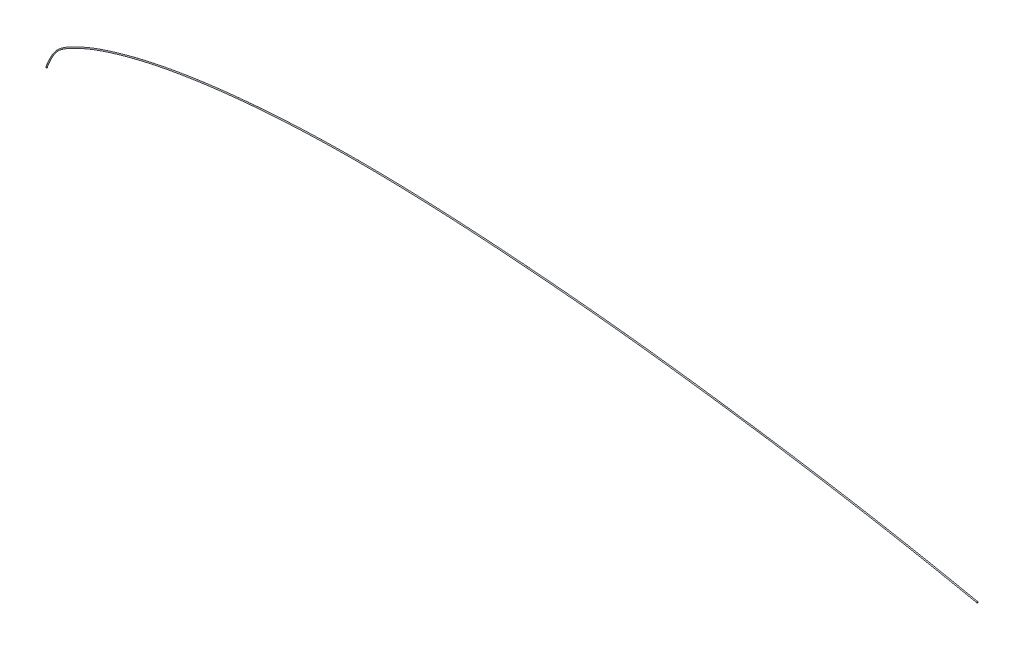
ISO-10303-21;
HEADER;
FILE_DESCRIPTION(('STEP AP214'),'2;1');
FILE_NAME('part.step','',(''),(''),'','','');
FILE_SCHEMA(('AUTOMOTIVE_DESIGN { 1 0 10303 214 1 1 1 1 }'));
ENDSEC;
DATA;
#1=APPLICATION_CONTEXT('core data for automotive mechanical design processes');
#2=APPLICATION_PROTOCOL_DEFINITION('international standard','automotive_design',2000,#1);
#3=PRODUCT_CONTEXT('',#1,'mechanical');
#4=PRODUCT('Part','Part','',(#3));
#5=PRODUCT_RELATED_PRODUCT_CATEGORY('part','',(#4));
#6=PRODUCT_DEFINITION_FORMATION('','',#4);
#7=PRODUCT_DEFINITION_CONTEXT('part definition',#1,'design');
#8=PRODUCT_DEFINITION('design','',#6,#7);
#9=PRODUCT_DEFINITION_SHAPE('','',#8);
#10=(LENGTH_UNIT() NAMED_UNIT(*) SI_UNIT(.MILLI.,.METRE.));
#11=(NAMED_UNIT(*) PLANE_ANGLE_UNIT() SI_UNIT($,.RADIAN.));
#12=(NAMED_UNIT(*) SI_UNIT($,.STERADIAN.) SOLID_ANGLE_UNIT());
#13=UNCERTAINTY_MEASURE_WITH_UNIT(LENGTH_MEASURE(1.E-05),#10,'distance_accuracy_value','');
#14=(GEOMETRIC_REPRESENTATION_CONTEXT(3) GLOBAL_UNCERTAINTY_ASSIGNED_CONTEXT((#13)) GLOBAL_UNIT_ASSIGNED_CONTEXT((#10,
#11,#12)) REPRESENTATION_CONTEXT('',''));
#15=CARTESIAN_POINT('',(0.,0.,0.));
#16=DIRECTION('',(0.,0.,1.));
#17=DIRECTION('',(1.,0.,0.));
#18=AXIS2_PLACEMENT_3D('',#15,#16,#17);
#19=CARTESIAN_POINT('',(821.6356482,1.068126343,0.));
#20=DIRECTION('',(0.981017726503732,0.193918076221502,0.));
#21=DIRECTION('',(0.,0.,1.));
#22=AXIS2_PLACEMENT_3D('',#19,#20,#21);
#23=PLANE('',#22);
#24=CARTESIAN_POINT('',(821.6356482,1.068126343,0.));
#25=DIRECTION('',(0.981017726503732,0.193918076221502,0.));
#26=DIRECTION('',(0.,0.,1.));
#27=AXIS2_PLACEMENT_3D('',#24,#25,#26);
#28=CIRCLE('',#27,0.5);
#29=CARTESIAN_POINT('',(821.6356482,1.068126343,0.5));
#30=VERTEX_POINT('',#29);
#31=EDGE_CURVE('E10',#30,#30,#28,.T.);
#32=ORIENTED_EDGE('',*,*,#31,.T.);
#33=EDGE_LOOP('',(#32));
#34=FACE_BOUND('',#33,.T.);
#35=ADVANCED_FACE('F37',(#34),#23,.T.);
#36=CARTESIAN_POINT('',(821.6356482,1.068126343,0.5));
#37=CARTESIAN_POINT('',(807.949315929663,3.8726429153105,0.5));
#38=CARTESIAN_POINT('',(794.262983662316,6.67715948740843,0.5));
#39=CARTESIAN_POINT('',(739.633161122471,17.3945662259603,0.5));
#40=CARTESIAN_POINT('',(698.520985277327,24.4397528855469,0.5));
#41=CARTESIAN_POINT('',(629.966146484422,35.0385581246609,0.5));
#42=CARTESIAN_POINT('',(602.577080222447,38.959971872981,0.5));
#43=CARTESIAN_POINT('',(547.800671683737,46.1499507530432,0.5));
#44=CARTESIAN_POINT('',(520.413604741873,49.4205662565359,0.5));
#45=CARTESIAN_POINT('',(465.632902318206,55.0828337222342,0.5));
#46=CARTESIAN_POINT('',(438.239542017067,57.4771380091737,0.5));
#47=CARTESIAN_POINT('',(383.4588721508,61.491104774006,0.5));
#48=CARTESIAN_POINT('',(356.071692251463,63.1125277966778,0.5));
#49=CARTESIAN_POINT('',(301.278840028551,65.0611391807135,0.5));
#50=CARTESIAN_POINT('',(273.873260344754,65.3903069812467,0.5));
#51=CARTESIAN_POINT('',(219.050983178815,64.0981242219825,0.5));
#52=CARTESIAN_POINT('',(191.625831459682,62.4953673804491,0.5));
#53=CARTESIAN_POINT('',(150.519756444238,58.2119719363067,0.5));
#54=CARTESIAN_POINT('',(136.746911380907,56.4497204796891,0.5));
#55=CARTESIAN_POINT('',(109.312975276132,52.1023120159522,0.5));
#56=CARTESIAN_POINT('',(95.6523716004522,49.5162650040087,0.5));
#57=CARTESIAN_POINT('',(75.2145134563756,44.5795659214063,0.5));
#58=CARTESIAN_POINT('',(68.3110453118406,42.7226758749477,0.5));
#59=CARTESIAN_POINT('',(54.5715738853773,38.6768513403353,0.5));
#60=CARTESIAN_POINT('',(47.7369220366168,36.48613199558,0.5));
#61=CARTESIAN_POINT('',(36.7868333276846,32.2862239545925,0.5));
#62=CARTESIAN_POINT('',(32.5666487945213,30.4881854096799,0.5));
#63=CARTESIAN_POINT('',(26.304073023569,27.528126593638,0.5));
#64=CARTESIAN_POINT('',(24.2278312714603,26.4976068219342,0.5));
#65=CARTESIAN_POINT('',(20.0905071442538,24.3427443365568,0.5));
#66=CARTESIAN_POINT('',(18.0104542591294,23.2313076901134,0.5));
#67=CARTESIAN_POINT('',(14.0414092535021,20.7837462409737,0.5));
#68=CARTESIAN_POINT('',(12.1591171256037,19.4430632819947,0.5));
#69=CARTESIAN_POINT('',(8.85776861999671,16.3406468875565,0.5));
#70=CARTESIAN_POINT('',(7.44791398536713,14.5716178291864,0.5));
#71=CARTESIAN_POINT('',(3.70331247112468,8.82625416327505,0.5));
#72=CARTESIAN_POINT('',(1.85165623404984,4.41312708300788,0.5));
#73=CARTESIAN_POINT('',(0.,0.,0.5));
#74=CARTESIAN_POINT('',(821.829566276221,0.0871086164962679,0.5));
#75=CARTESIAN_POINT('',(808.143234005109,2.89162518881434,0.5));
#76=CARTESIAN_POINT('',(794.459648892403,5.69667282231044,0.5));
#77=CARTESIAN_POINT('',(739.851664847713,16.4185871723018,0.5));
#78=CARTESIAN_POINT('',(698.751553264622,23.4666318050417,0.5));
#79=CARTESIAN_POINT('',(630.214850913112,34.0699500146192,0.5));
#80=CARTESIAN_POINT('',(602.833163547742,37.9932857265177,0.5));
#81=CARTESIAN_POINT('',(548.071771140847,45.1873680445874,0.5));
#82=CARTESIAN_POINT('',(520.69352836485,48.4604857335446,0.5));
#83=CARTESIAN_POINT('',(465.933037174779,54.1288786757165,0.5));
#84=CARTESIAN_POINT('',(438.54915051956,56.5262278139028,0.5));
#85=CARTESIAN_POINT('',(383.786207048643,60.5461502311617,0.5));
#86=CARTESIAN_POINT('',(356.410871943892,62.1716748057665,0.5));
#87=CARTESIAN_POINT('',(301.647408374213,64.1314059760279,0.5));
#88=CARTESIAN_POINT('',(274.26012686118,64.4678660344989,0.5));
#89=CARTESIAN_POINT('',(219.481209622185,63.195090135347,0.5));
#90=CARTESIAN_POINT('',(192.079130629167,61.6034739262708,0.5));
#91=CARTESIAN_POINT('',(151.013848194414,57.3424218142517,0.5));
#92=CARTESIAN_POINT('',(137.256390445649,55.5890056571223,0.5));
#93=CARTESIAN_POINT('',(109.856416526692,51.2626272355951,0.5));
#94=CARTESIAN_POINT('',(96.2181232764169,48.691016169331,0.5));
#95=CARTESIAN_POINT('',(75.8209381063033,43.7842396370035,0.5));
#96=CARTESIAN_POINT('',(68.9303341859064,41.9373515150608,0.5));
#97=CARTESIAN_POINT('',(55.2155287307647,37.9116224746726,0.5));
#98=CARTESIAN_POINT('',(48.4012159988485,35.7377148490799,0.5));
#99=CARTESIAN_POINT('',(37.4958342417088,31.5805987667842,0.5));
#100=CARTESIAN_POINT('',(33.2933387393552,29.8007404167443,0.5));
#101=CARTESIAN_POINT('',(27.0564967663197,26.8693221955771,0.5));
#102=CARTESIAN_POINT('',(24.9887005302942,25.8485735419041,0.5));
#103=CARTESIAN_POINT('',(20.867856589028,23.7135432015166,0.5));
#104=CARTESIAN_POINT('',(18.7983033095419,22.6138841084808,0.5));
#105=CARTESIAN_POINT('',(14.8802185418365,20.2375622216578,0.5));
#106=CARTESIAN_POINT('',(13.0351612568077,18.952165987822,0.5));
#107=CARTESIAN_POINT('',(9.8085681815603,16.0175158516353,0.5));
#108=CARTESIAN_POINT('',(8.42047072883891,14.3306814336119,0.5));
#109=CARTESIAN_POINT('',(4.7095463844487,8.77002982291899,0.5));
#110=CARTESIAN_POINT('',(2.8516562340514,4.41312708300855,0.5));
#111=CARTESIAN_POINT('',(1.,0.,0.5));
#112=CARTESIAN_POINT('',(821.829566276221,0.0871086164962679,-0.5));
#113=CARTESIAN_POINT('',(808.143234005109,2.89162518881434,-0.5));
#114=CARTESIAN_POINT('',(794.459648892403,5.69667282231044,-0.5));
#115=CARTESIAN_POINT('',(739.851664847713,16.4185871723018,-0.5));
#116=CARTESIAN_POINT('',(698.751553264622,23.4666318050417,-0.5));
#117=CARTESIAN_POINT('',(630.214850913112,34.0699500146192,-0.5));
#118=CARTESIAN_POINT('',(602.833163547742,37.9932857265177,-0.5));
#119=CARTESIAN_POINT('',(548.071771140847,45.1873680445874,-0.5));
#120=CARTESIAN_POINT('',(520.69352836485,48.4604857335446,-0.5));
#121=CARTESIAN_POINT('',(465.933037174779,54.1288786757165,-0.5));
#122=CARTESIAN_POINT('',(438.54915051956,56.5262278139028,-0.5));
#123=CARTESIAN_POINT('',(383.786207048643,60.5461502311617,-0.5));
#124=CARTESIAN_POINT('',(356.410871943892,62.1716748057665,-0.5));
#125=CARTESIAN_POINT('',(301.647408374213,64.1314059760279,-0.5));
#126=CARTESIAN_POINT('',(274.26012686118,64.4678660344989,-0.5));
#127=CARTESIAN_POINT('',(219.481209622185,63.195090135347,-0.5));
#128=CARTESIAN_POINT('',(192.079130629167,61.6034739262708,-0.5));
#129=CARTESIAN_POINT('',(151.013848194414,57.3424218142517,-0.5));
#130=CARTESIAN_POINT('',(137.256390445649,55.5890056571223,-0.5));
#131=CARTESIAN_POINT('',(109.856416526692,51.2626272355951,-0.5));
#132=CARTESIAN_POINT('',(96.2181232764169,48.691016169331,-0.5));
#133=CARTESIAN_POINT('',(75.8209381063033,43.7842396370035,-0.5));
#134=CARTESIAN_POINT('',(68.9303341859064,41.9373515150608,-0.5));
#135=CARTESIAN_POINT('',(55.2155287307647,37.9116224746726,-0.5));
#136=CARTESIAN_POINT('',(48.4012159988485,35.7377148490799,-0.5));
#137=CARTESIAN_POINT('',(37.4958342417088,31.5805987667842,-0.5));
#138=CARTESIAN_POINT('',(33.2933387393552,29.8007404167443,-0.5));
#139=CARTESIAN_POINT('',(27.0564967663197,26.8693221955771,-0.5));
#140=CARTESIAN_POINT('',(24.9887005302942,25.8485735419041,-0.5));
#141=CARTESIAN_POINT('',(20.867856589028,23.7135432015166,-0.5));
#142=CARTESIAN_POINT('',(18.7983033095419,22.6138841084808,-0.5));
#143=CARTESIAN_POINT('',(14.8802185418365,20.2375622216578,-0.5));
#144=CARTESIAN_POINT('',(13.0351612568077,18.952165987822,-0.5));
#145=CARTESIAN_POINT('',(9.8085681815603,16.0175158516353,-0.5));
#146=CARTESIAN_POINT('',(8.42047072883891,14.3306814336119,-0.5));
#147=CARTESIAN_POINT('',(4.7095463844487,8.77002982291899,-0.5));
#148=CARTESIAN_POINT('',(2.8516562340514,4.41312708300855,-0.5));
#149=CARTESIAN_POINT('',(1.,0.,-0.5));
#150=CARTESIAN_POINT('',(821.6356482,1.068126343,-0.5));
#151=CARTESIAN_POINT('',(807.949315929663,3.8726429153105,-0.5));
#152=CARTESIAN_POINT('',(794.262983662316,6.67715948740843,-0.5));
#153=CARTESIAN_POINT('',(739.633161122471,17.3945662259603,-0.5));
#154=CARTESIAN_POINT('',(698.520985277327,24.4397528855469,-0.5));
#155=CARTESIAN_POINT('',(629.966146484422,35.0385581246609,-0.5));
#156=CARTESIAN_POINT('',(602.577080222447,38.959971872981,-0.5));
#157=CARTESIAN_POINT('',(547.800671683737,46.1499507530432,-0.5));
#158=CARTESIAN_POINT('',(520.413604741873,49.4205662565359,-0.5));
#159=CARTESIAN_POINT('',(465.632902318206,55.0828337222342,-0.5));
#160=CARTESIAN_POINT('',(438.239542017067,57.4771380091737,-0.5));
#161=CARTESIAN_POINT('',(383.4588721508,61.491104774006,-0.5));
#162=CARTESIAN_POINT('',(356.071692251463,63.1125277966778,-0.5));
#163=CARTESIAN_POINT('',(301.278840028551,65.0611391807135,-0.5));
#164=CARTESIAN_POINT('',(273.873260344754,65.3903069812467,-0.5));
#165=CARTESIAN_POINT('',(219.050983178815,64.0981242219825,-0.5));
#166=CARTESIAN_POINT('',(191.625831459682,62.4953673804491,-0.5));
#167=CARTESIAN_POINT('',(150.519756444238,58.2119719363067,-0.5));
#168=CARTESIAN_POINT('',(136.746911380907,56.4497204796891,-0.5));
#169=CARTESIAN_POINT('',(109.312975276132,52.1023120159522,-0.5));
#170=CARTESIAN_POINT('',(95.6523716004522,49.5162650040087,-0.5));
#171=CARTESIAN_POINT('',(75.2145134563756,44.5795659214063,-0.5));
#172=CARTESIAN_POINT('',(68.3110453118406,42.7226758749477,-0.5));
#173=CARTESIAN_POINT('',(54.5715738853773,38.6768513403353,-0.5));
#174=CARTESIAN_POINT('',(47.7369220366168,36.48613199558,-0.5));
#175=CARTESIAN_POINT('',(36.7868333276846,32.2862239545925,-0.5));
#176=CARTESIAN_POINT('',(32.5666487945213,30.4881854096799,-0.5));
#177=CARTESIAN_POINT('',(26.304073023569,27.528126593638,-0.5));
#178=CARTESIAN_POINT('',(24.2278312714603,26.4976068219342,-0.5));
#179=CARTESIAN_POINT('',(20.0905071442538,24.3427443365568,-0.5));
#180=CARTESIAN_POINT('',(18.0104542591294,23.2313076901134,-0.5));
#181=CARTESIAN_POINT('',(14.0414092535021,20.7837462409737,-0.5));
#182=CARTESIAN_POINT('',(12.1591171256037,19.4430632819947,-0.5));
#183=CARTESIAN_POINT('',(8.85776861999671,16.3406468875565,-0.5));
#184=CARTESIAN_POINT('',(7.44791398536713,14.5716178291864,-0.5));
#185=CARTESIAN_POINT('',(3.70331247112468,8.82625416327505,-0.5));
#186=CARTESIAN_POINT('',(1.85165623404984,4.41312708300788,-0.5));
#187=CARTESIAN_POINT('',(0.,0.,-0.5));
#188=CARTESIAN_POINT('',(821.441730123778,2.04914406950373,-0.5));
#189=CARTESIAN_POINT('',(807.755397854217,4.85366064180666,-0.5));
#190=CARTESIAN_POINT('',(794.066318432229,7.65764615250642,-0.5));
#191=CARTESIAN_POINT('',(739.414657397228,18.3705452796188,-0.5));
#192=CARTESIAN_POINT('',(698.290417290032,25.4128739660522,-0.5));
#193=CARTESIAN_POINT('',(629.717442055732,36.0071662347027,-0.5));
#194=CARTESIAN_POINT('',(602.320996897153,39.9266580194443,-0.5));
#195=CARTESIAN_POINT('',(547.529572226628,47.1125334614991,-0.5));
#196=CARTESIAN_POINT('',(520.133681118897,50.3806467795272,-0.5));
#197=CARTESIAN_POINT('',(465.332767461632,56.036788768752,-0.5));
#198=CARTESIAN_POINT('',(437.929933514575,58.4280482044446,-0.5));
#199=CARTESIAN_POINT('',(383.131537252957,62.4360593168503,-0.5));
#200=CARTESIAN_POINT('',(355.732512559033,64.053380787589,-0.5));
#201=CARTESIAN_POINT('',(300.910271682889,65.9908723853991,-0.5));
#202=CARTESIAN_POINT('',(273.486393828329,66.3127479279945,-0.5));
#203=CARTESIAN_POINT('',(218.620756735446,65.001158308618,-0.5));
#204=CARTESIAN_POINT('',(191.172532290196,63.3872608346273,-0.5));
#205=CARTESIAN_POINT('',(150.025664694062,59.0815220583617,-0.5));
#206=CARTESIAN_POINT('',(136.237432316164,57.3104353022559,-0.5));
#207=CARTESIAN_POINT('',(108.769534025572,52.9419967963094,-0.5));
#208=CARTESIAN_POINT('',(95.0866199244875,50.3415138386864,-0.5));
#209=CARTESIAN_POINT('',(74.6080888064479,45.3748922058091,-0.5));
#210=CARTESIAN_POINT('',(67.6917564377748,43.5080002348346,-0.5));
#211=CARTESIAN_POINT('',(53.92761903999,39.4420802059979,-0.5));
#212=CARTESIAN_POINT('',(47.0726280743852,37.2345491420799,-0.5));
#213=CARTESIAN_POINT('',(36.0778324136605,32.9918491424008,-0.5));
#214=CARTESIAN_POINT('',(31.8399588496875,31.1756304026156,-0.5));
#215=CARTESIAN_POINT('',(25.5516492808184,28.1869309916988,-0.5));
#216=CARTESIAN_POINT('',(23.4669620126264,27.1466401019643,-0.5));
#217=CARTESIAN_POINT('',(19.3131576994795,24.971945471597,-0.5));
#218=CARTESIAN_POINT('',(17.2226052087169,23.8487312717461,-0.5));
#219=CARTESIAN_POINT('',(13.2025999651678,21.3299302602897,-0.5));
#220=CARTESIAN_POINT('',(11.2830729943998,19.9339605761674,-0.5));
#221=CARTESIAN_POINT('',(7.90696905843312,16.6637779234776,-0.5));
#222=CARTESIAN_POINT('',(6.47535724189535,14.8125542247609,-0.5));
#223=CARTESIAN_POINT('',(2.69707855780067,8.88247850363111,-0.5));
#224=CARTESIAN_POINT('',(0.851656234048288,4.41312708300722,-0.5));
#225=CARTESIAN_POINT('',(-1.,0.,-0.5));
#226=CARTESIAN_POINT('',(821.441730123778,2.04914406950373,0.5));
#227=CARTESIAN_POINT('',(807.755397854217,4.85366064180666,0.5));
#228=CARTESIAN_POINT('',(794.066318432229,7.65764615250642,0.5));
#229=CARTESIAN_POINT('',(739.414657397228,18.3705452796188,0.5));
#230=CARTESIAN_POINT('',(698.290417290032,25.4128739660522,0.5));
#231=CARTESIAN_POINT('',(629.717442055732,36.0071662347027,0.5));
#232=CARTESIAN_POINT('',(602.320996897153,39.9266580194443,0.5));
#233=CARTESIAN_POINT('',(547.529572226628,47.1125334614991,0.5));
#234=CARTESIAN_POINT('',(520.133681118897,50.3806467795272,0.5));
#235=CARTESIAN_POINT('',(465.332767461632,56.036788768752,0.5));
#236=CARTESIAN_POINT('',(437.929933514575,58.4280482044446,0.5));
#237=CARTESIAN_POINT('',(383.131537252957,62.4360593168503,0.5));
#238=CARTESIAN_POINT('',(355.732512559033,64.053380787589,0.5));
#239=CARTESIAN_POINT('',(300.910271682889,65.9908723853991,0.5));
#240=CARTESIAN_POINT('',(273.486393828329,66.3127479279945,0.5));
#241=CARTESIAN_POINT('',(218.620756735446,65.001158308618,0.5));
#242=CARTESIAN_POINT('',(191.172532290196,63.3872608346273,0.5));
#243=CARTESIAN_POINT('',(150.025664694062,59.0815220583617,0.5));
#244=CARTESIAN_POINT('',(136.237432316164,57.3104353022559,0.5));
#245=CARTESIAN_POINT('',(108.769534025572,52.9419967963094,0.5));
#246=CARTESIAN_POINT('',(95.0866199244875,50.3415138386864,0.5));
#247=CARTESIAN_POINT('',(74.6080888064479,45.3748922058091,0.5));
#248=CARTESIAN_POINT('',(67.6917564377748,43.5080002348346,0.5));
#249=CARTESIAN_POINT('',(53.92761903999,39.4420802059979,0.5));
#250=CARTESIAN_POINT('',(47.0726280743852,37.2345491420799,0.5));
#251=CARTESIAN_POINT('',(36.0778324136605,32.9918491424008,0.5));
#252=CARTESIAN_POINT('',(31.8399588496875,31.1756304026156,0.5));
#253=CARTESIAN_POINT('',(25.5516492808184,28.1869309916988,0.5));
#254=CARTESIAN_POINT('',(23.4669620126264,27.1466401019643,0.5));
#255=CARTESIAN_POINT('',(19.3131576994795,24.971945471597,0.5));
#256=CARTESIAN_POINT('',(17.2226052087169,23.8487312717461,0.5));
#257=CARTESIAN_POINT('',(13.2025999651678,21.3299302602897,0.5));
#258=CARTESIAN_POINT('',(11.2830729943998,19.9339605761674,0.5));
#259=CARTESIAN_POINT('',(7.90696905843312,16.6637779234776,0.5));
#260=CARTESIAN_POINT('',(6.47535724189535,14.8125542247609,0.5));
#261=CARTESIAN_POINT('',(2.69707855780067,8.88247850363111,0.5));
#262=CARTESIAN_POINT('',(0.851656234048288,4.41312708300722,0.5));
#263=CARTESIAN_POINT('',(-1.,0.,0.5));
#264=CARTESIAN_POINT('',(821.6356482,1.068126343,0.5));
#265=CARTESIAN_POINT('',(807.949315929663,3.8726429153105,0.5));
#266=CARTESIAN_POINT('',(794.262983662316,6.67715948740843,0.5));
#267=CARTESIAN_POINT('',(739.633161122471,17.3945662259603,0.5));
#268=CARTESIAN_POINT('',(698.520985277327,24.4397528855469,0.5));
#269=CARTESIAN_POINT('',(629.966146484422,35.0385581246609,0.5));
#270=CARTESIAN_POINT('',(602.577080222447,38.959971872981,0.5));
#271=CARTESIAN_POINT('',(547.800671683737,46.1499507530432,0.5));
#272=CARTESIAN_POINT('',(520.413604741873,49.4205662565359,0.5));
#273=CARTESIAN_POINT('',(465.632902318206,55.0828337222342,0.5));
#274=CARTESIAN_POINT('',(438.239542017067,57.4771380091737,0.5));
#275=CARTESIAN_POINT('',(383.4588721508,61.491104774006,0.5));
#276=CARTESIAN_POINT('',(356.071692251463,63.1125277966778,0.5));
#277=CARTESIAN_POINT('',(301.278840028551,65.0611391807135,0.5));
#278=CARTESIAN_POINT('',(273.873260344754,65.3903069812467,0.5));
#279=CARTESIAN_POINT('',(219.050983178815,64.0981242219825,0.5));
#280=CARTESIAN_POINT('',(191.625831459682,62.4953673804491,0.5));
#281=CARTESIAN_POINT('',(150.519756444238,58.2119719363067,0.5));
#282=CARTESIAN_POINT('',(136.746911380907,56.4497204796891,0.5));
#283=CARTESIAN_POINT('',(109.312975276132,52.1023120159522,0.5));
#284=CARTESIAN_POINT('',(95.6523716004522,49.5162650040087,0.5));
#285=CARTESIAN_POINT('',(75.2145134563756,44.5795659214063,0.5));
#286=CARTESIAN_POINT('',(68.3110453118406,42.7226758749477,0.5));
#287=CARTESIAN_POINT('',(54.5715738853773,38.6768513403353,0.5));
#288=CARTESIAN_POINT('',(47.7369220366168,36.48613199558,0.5));
#289=CARTESIAN_POINT('',(36.7868333276846,32.2862239545925,0.5));
#290=CARTESIAN_POINT('',(32.5666487945213,30.4881854096799,0.5));
#291=CARTESIAN_POINT('',(26.304073023569,27.528126593638,0.5));
#292=CARTESIAN_POINT('',(24.2278312714603,26.4976068219342,0.5));
#293=CARTESIAN_POINT('',(20.0905071442538,24.3427443365568,0.5));
#294=CARTESIAN_POINT('',(18.0104542591294,23.2313076901134,0.5));
#295=CARTESIAN_POINT('',(14.0414092535021,20.7837462409737,0.5));
#296=CARTESIAN_POINT('',(12.1591171256037,19.4430632819947,0.5));
#297=CARTESIAN_POINT('',(8.85776861999671,16.3406468875565,0.5));
#298=CARTESIAN_POINT('',(7.44791398536713,14.5716178291864,0.5));
#299=CARTESIAN_POINT('',(3.70331247112468,8.82625416327505,0.5));
#300=CARTESIAN_POINT('',(1.85165623404984,4.41312708300788,0.5));
#301=CARTESIAN_POINT('',(0.,0.,0.5));
#302=(BOUNDED_SURFACE() B_SPLINE_SURFACE(3,3,((#36,#37,#38,#39,#40,#41,#42,#43,#44,#45,#46,#47,
#48,#49,#50,#51,#52,#53,#54,#55,#56,#57,#58,#59,#60,#61,#62,#63,#64,#65,#66,#67,#68,#69,#70,#71,
#72,#73),(#74,#75,#76,#77,#78,#79,#80,#81,#82,#83,#84,#85,#86,#87,#88,#89,#90,#91,#92,#93,#94,
#95,#96,#97,#98,#99,#100,#101,#102,#103,#104,#105,#106,#107,#108,#109,#110,#111),(#112,#113,
#114,#115,#116,#117,#118,#119,#120,#121,#122,#123,#124,#125,#126,#127,#128,#129,#130,#131,#132,
#133,#134,#135,#136,#137,#138,#139,#140,#141,#142,#143,#144,#145,#146,#147,#148,#149),(#150,
#151,#152,#153,#154,#155,#156,#157,#158,#159,#160,#161,#162,#163,#164,#165,#166,#167,#168,#169,
#170,#171,#172,#173,#174,#175,#176,#177,#178,#179,#180,#181,#182,#183,#184,#185,#186,#187),
(#188,#189,#190,#191,#192,#193,#194,#195,#196,#197,#198,#199,#200,#201,#202,#203,#204,#205,#206,
#207,#208,#209,#210,#211,#212,#213,#214,#215,#216,#217,#218,#219,#220,#221,#222,#223,#224,#225),
(#226,#227,#228,#229,#230,#231,#232,#233,#234,#235,#236,#237,#238,#239,#240,#241,#242,#243,#244,
#245,#246,#247,#248,#249,#250,#251,#252,#253,#254,#255,#256,#257,#258,#259,#260,#261,#262,#263),
(#264,#265,#266,#267,#268,#269,#270,#271,#272,#273,#274,#275,#276,#277,#278,#279,#280,#281,#282,
#283,#284,#285,#286,#287,#288,#289,#290,#291,#292,#293,#294,#295,#296,#297,#298,#299,#300,
#301)),.UNSPECIFIED.,.T.,.F.,.F.) B_SPLINE_SURFACE_WITH_KNOTS((4,3,4),(4,2,2,2,2,2,2,2,2,2,2,2,
2,2,2,2,2,2,4),(0.,0.5,1.),(0.,0.0496812988394548,0.197976307914676,0.296362491107645,
0.3944336172207,0.492205408315692,0.589753408139956,0.687151928235106,0.784753711434451,
0.834119584149869,0.883485456865287,0.908917356861565,0.934349256857844,0.950761942643383,
0.958968285536152,0.967174628428922,0.975380971321691,0.983587314214461,1.),
.UNSPECIFIED.) GEOMETRIC_REPRESENTATION_ITEM() RATIONAL_B_SPLINE_SURFACE(((1.,1.,1.,1.,1.,1.,1.,
1.,1.,1.,1.,1.,1.,1.,1.,1.,1.,1.,1.,1.,1.,1.,1.,1.,1.,1.,1.,1.,1.,1.,1.,1.,1.,1.,1.,1.,1.,1.),
(0.333333333333333,0.333333333333333,0.333333333333333,0.333333333333333,0.333333333333333,
0.333333333333333,0.333333333333333,0.333333333333333,0.333333333333333,0.333333333333333,
0.333333333333333,0.333333333333333,0.333333333333333,0.333333333333333,0.333333333333333,
0.333333333333333,0.333333333333333,0.333333333333333,0.333333333333333,0.333333333333333,
0.333333333333333,0.333333333333333,0.333333333333333,0.333333333333333,0.333333333333333,
0.333333333333333,0.333333333333333,0.333333333333333,0.333333333333333,0.333333333333333,
0.333333333333333,0.333333333333333,0.333333333333333,0.333333333333333,0.333333333333333,
0.333333333333333,0.333333333333333,0.333333333333333),(0.333333333333333,0.333333333333333,
0.333333333333333,0.333333333333333,0.333333333333333,0.333333333333333,0.333333333333333,
0.333333333333333,0.333333333333333,0.333333333333333,0.333333333333333,0.333333333333333,
0.333333333333333,0.333333333333333,0.333333333333333,0.333333333333333,0.333333333333333,
0.333333333333333,0.333333333333333,0.333333333333333,0.333333333333333,0.333333333333333,
0.333333333333333,0.333333333333333,0.333333333333333,0.333333333333333,0.333333333333333,
0.333333333333333,0.333333333333333,0.333333333333333,0.333333333333333,0.333333333333333,
0.333333333333333,0.333333333333333,0.333333333333333,0.333333333333333,0.333333333333333,
0.333333333333333),(1.,1.,1.,1.,1.,1.,1.,1.,1.,1.,1.,1.,1.,1.,1.,1.,1.,1.,1.,1.,1.,1.,1.,1.,1.,
1.,1.,1.,1.,1.,1.,1.,1.,1.,1.,1.,1.,1.),(0.333333333333333,0.333333333333333,0.333333333333333,
0.333333333333333,0.333333333333333,0.333333333333333,0.333333333333333,0.333333333333333,
0.333333333333333,0.333333333333333,0.333333333333333,0.333333333333333,0.333333333333333,
0.333333333333333,0.333333333333333,0.333333333333333,0.333333333333333,0.333333333333333,
0.333333333333333,0.333333333333333,0.333333333333333,0.333333333333333,0.333333333333333,
0.333333333333333,0.333333333333333,0.333333333333333,0.333333333333333,0.333333333333333,
0.333333333333333,0.333333333333333,0.333333333333333,0.333333333333333,0.333333333333333,
0.333333333333333,0.333333333333333,0.333333333333333,0.333333333333333,0.333333333333333),
(0.333333333333333,0.333333333333333,0.333333333333333,0.333333333333333,0.333333333333333,
0.333333333333333,0.333333333333333,0.333333333333333,0.333333333333333,0.333333333333333,
0.333333333333333,0.333333333333333,0.333333333333333,0.333333333333333,0.333333333333333,
0.333333333333333,0.333333333333333,0.333333333333333,0.333333333333333,0.333333333333333,
0.333333333333333,0.333333333333333,0.333333333333333,0.333333333333333,0.333333333333333,
0.333333333333333,0.333333333333333,0.333333333333333,0.333333333333333,0.333333333333333,
0.333333333333333,0.333333333333333,0.333333333333333,0.333333333333333,0.333333333333333,
0.333333333333333,0.333333333333333,0.333333333333333),(1.,1.,1.,1.,1.,1.,1.,1.,1.,1.,1.,1.,1.,
1.,1.,1.,1.,1.,1.,1.,1.,1.,1.,1.,1.,1.,1.,1.,1.,1.,1.,1.,1.,1.,1.,1.,1.,1.))) REPRESENTATION_ITEM('') SURFACE());
#303=CARTESIAN_POINT('',(0.,0.,0.));
#304=DIRECTION('',(0.,1.,0.));
#305=DIRECTION('',(0.,0.,1.));
#306=AXIS2_PLACEMENT_3D('',#303,#304,#305);
#307=CIRCLE('',#306,0.5);
#308=CARTESIAN_POINT('',(0.,0.,0.5));
#309=VERTEX_POINT('',#308);
#310=EDGE_CURVE('E47',#309,#309,#307,.T.);
#311=ORIENTED_EDGE('',*,*,#310,.T.);
#312=EDGE_LOOP('',(#311));
#313=FACE_BOUND('',#312,.T.);
#314=ORIENTED_EDGE('',*,*,#31,.F.);
#315=EDGE_LOOP('',(#314));
#316=FACE_BOUND('',#315,.T.);
#317=ADVANCED_FACE('F54',(#313,#316),#302,.F.);
#318=CARTESIAN_POINT('',(0.,-1.,0.));
#319=DIRECTION('',(0.,1.,0.));
#320=DIRECTION('',(0.,0.,1.));
#321=AXIS2_PLACEMENT_3D('',#318,#319,#320);
#322=CYLINDRICAL_SURFACE('',#321,0.5);
#323=CARTESIAN_POINT('',(0.,-1.,0.));
#324=DIRECTION('',(0.,1.,0.));
#325=DIRECTION('',(0.,0.,1.));
#326=AXIS2_PLACEMENT_3D('',#323,#324,#325);
#327=CIRCLE('',#326,0.5);
#328=CARTESIAN_POINT('',(0.,-1.,0.5));
#329=VERTEX_POINT('',#328);
#330=EDGE_CURVE('E43',#329,#329,#327,.T.);
#331=ORIENTED_EDGE('',*,*,#330,.T.);
#332=EDGE_LOOP('',(#331));
#333=FACE_BOUND('',#332,.T.);
#334=ORIENTED_EDGE('',*,*,#310,.F.);
#335=EDGE_LOOP('',(#334));
#336=FACE_BOUND('',#335,.T.);
#337=ADVANCED_FACE('F57',(#333,#336),#322,.T.);
#338=CARTESIAN_POINT('',(0.,-1.,0.));
#339=DIRECTION('',(0.,1.,0.));
#340=DIRECTION('',(0.,0.,1.));
#341=AXIS2_PLACEMENT_3D('',#338,#339,#340);
#342=PLANE('',#341);
#343=ORIENTED_EDGE('',*,*,#330,.F.);
#344=EDGE_LOOP('',(#343));
#345=FACE_BOUND('',#344,.T.);
#346=ADVANCED_FACE('F59',(#345),#342,.F.);
#347=CLOSED_SHELL('',(#35,#317,#337,#346));
#348=MANIFOLD_SOLID_BREP('B2',#347);
#349=ADVANCED_BREP_SHAPE_REPRESENTATION('',(#18,#348),#14);
#350=SHAPE_DEFINITION_REPRESENTATION(#9,#349);
ENDSEC;
END-ISO-10303-21;
